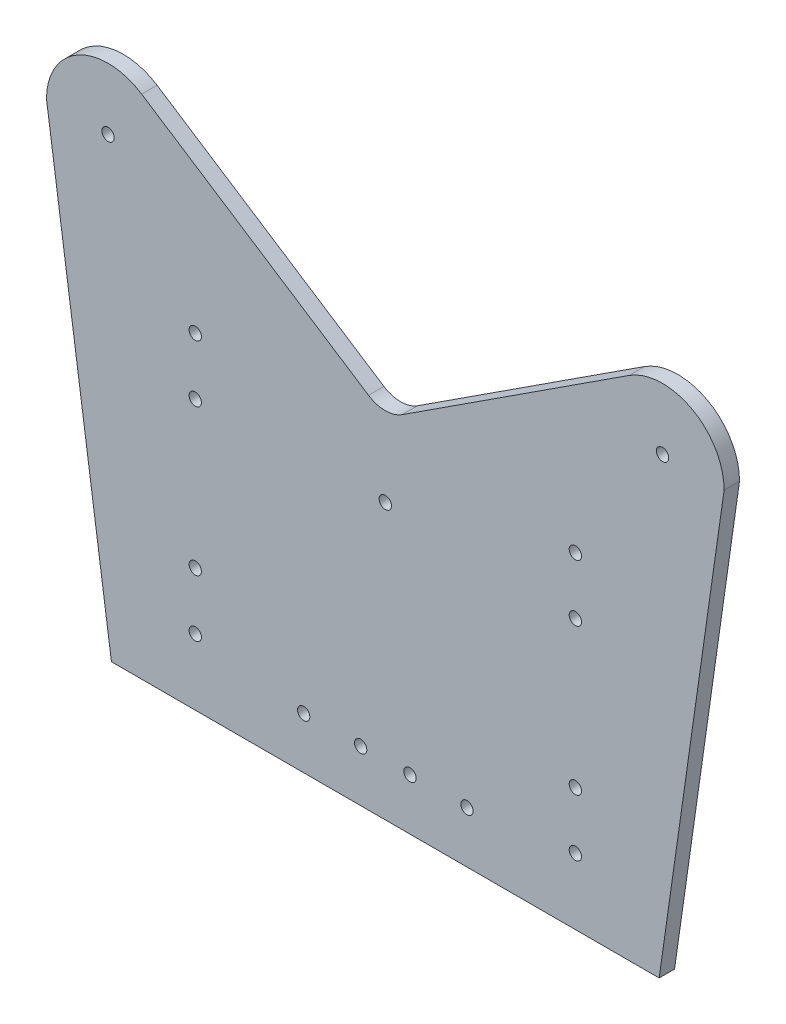
ISO-10303-21;
HEADER;
FILE_DESCRIPTION(('STEP AP214'),'2;1');
FILE_NAME('part.step','',(''),(''),'','','');
FILE_SCHEMA(('AUTOMOTIVE_DESIGN { 1 0 10303 214 1 1 1 1 }'));
ENDSEC;
DATA;
#1=APPLICATION_CONTEXT('core data for automotive mechanical design processes');
#2=APPLICATION_PROTOCOL_DEFINITION('international standard','automotive_design',2000,#1);
#3=PRODUCT_CONTEXT('',#1,'mechanical');
#4=PRODUCT('Part','Part','',(#3));
#5=PRODUCT_RELATED_PRODUCT_CATEGORY('part','',(#4));
#6=PRODUCT_DEFINITION_FORMATION('','',#4);
#7=PRODUCT_DEFINITION_CONTEXT('part definition',#1,'design');
#8=PRODUCT_DEFINITION('design','',#6,#7);
#9=PRODUCT_DEFINITION_SHAPE('','',#8);
#10=(LENGTH_UNIT() NAMED_UNIT(*) SI_UNIT(.MILLI.,.METRE.));
#11=(NAMED_UNIT(*) PLANE_ANGLE_UNIT() SI_UNIT($,.RADIAN.));
#12=(NAMED_UNIT(*) SI_UNIT($,.STERADIAN.) SOLID_ANGLE_UNIT());
#13=UNCERTAINTY_MEASURE_WITH_UNIT(LENGTH_MEASURE(1.E-05),#10,'distance_accuracy_value','');
#14=(GEOMETRIC_REPRESENTATION_CONTEXT(3) GLOBAL_UNCERTAINTY_ASSIGNED_CONTEXT((#13)) GLOBAL_UNIT_ASSIGNED_CONTEXT((#10,
#11,#12)) REPRESENTATION_CONTEXT('',''));
#15=CARTESIAN_POINT('',(0.,0.,0.));
#16=DIRECTION('',(0.,0.,1.));
#17=DIRECTION('',(1.,0.,0.));
#18=AXIS2_PLACEMENT_3D('',#15,#16,#17);
#19=CARTESIAN_POINT('',(-87.1367812034147,-12.437613765437,5.));
#20=DIRECTION('',(0.989966184075695,0.141304474050213,0.));
#21=DIRECTION('',(-0.141304474050213,0.989966184075695,0.));
#22=AXIS2_PLACEMENT_3D('',#19,#20,#21);
#23=PLANE('',#22);
#24=DIRECTION('',(0.141304474050213,-0.989966184075695,0.));
#25=VECTOR('',#24,1.);
#26=CARTESIAN_POINT('',(-87.1367812034147,-12.437613765437,0.));
#27=LINE('',#26,#25);
#28=CARTESIAN_POINT('',(-110.,147.74,0.));
#29=VERTEX_POINT('',#28);
#30=CARTESIAN_POINT('',(-88.9120847439146,0.,0.));
#31=VERTEX_POINT('',#30);
#32=EDGE_CURVE('E203',#29,#31,#27,.T.);
#33=ORIENTED_EDGE('',*,*,#32,.T.);
#34=DIRECTION('',(0.,0.,-1.));
#35=VECTOR('',#34,1.);
#36=CARTESIAN_POINT('',(-88.9120847439146,0.,5.));
#37=LINE('',#36,#35);
#38=CARTESIAN_POINT('',(-88.9120847439146,0.,5.));
#39=VERTEX_POINT('',#38);
#40=EDGE_CURVE('E11',#39,#31,#37,.T.);
#41=ORIENTED_EDGE('',*,*,#40,.F.);
#42=DIRECTION('',(0.141304474050213,-0.989966184075695,0.));
#43=VECTOR('',#42,1.);
#44=CARTESIAN_POINT('',(-87.1367812034147,-12.437613765437,5.));
#45=LINE('',#44,#43);
#46=CARTESIAN_POINT('',(-110.,147.74,5.));
#47=VERTEX_POINT('',#46);
#48=EDGE_CURVE('E322',#47,#39,#45,.T.);
#49=ORIENTED_EDGE('',*,*,#48,.F.);
#50=DIRECTION('',(0.,0.,-1.));
#51=VECTOR('',#50,1.);
#52=CARTESIAN_POINT('',(-110.,147.74,5.));
#53=LINE('',#52,#51);
#54=EDGE_CURVE('E198',#47,#29,#53,.T.);
#55=ORIENTED_EDGE('',*,*,#54,.T.);
#56=EDGE_LOOP('',(#33,#41,#49,#55));
#57=FACE_BOUND('',#56,.T.);
#58=ADVANCED_FACE('F41',(#57),#23,.F.);
#59=CARTESIAN_POINT('',(0.,0.,5.));
#60=DIRECTION('',(0.,1.,0.));
#61=DIRECTION('',(0.,0.,1.));
#62=AXIS2_PLACEMENT_3D('',#59,#60,#61);
#63=PLANE('',#62);
#64=DIRECTION('',(1.,0.,0.));
#65=VECTOR('',#64,1.);
#66=CARTESIAN_POINT('',(0.,0.,0.));
#67=LINE('',#66,#65);
#68=CARTESIAN_POINT('',(88.9120847439146,0.,0.));
#69=VERTEX_POINT('',#68);
#70=EDGE_CURVE('E207',#31,#69,#67,.T.);
#71=ORIENTED_EDGE('',*,*,#70,.T.);
#72=DIRECTION('',(0.,0.,-1.));
#73=VECTOR('',#72,1.);
#74=CARTESIAN_POINT('',(88.9120847439146,0.,5.));
#75=LINE('',#74,#73);
#76=CARTESIAN_POINT('',(88.9120847439146,0.,5.));
#77=VERTEX_POINT('',#76);
#78=EDGE_CURVE('E51',#77,#69,#75,.T.);
#79=ORIENTED_EDGE('',*,*,#78,.F.);
#80=DIRECTION('',(1.,0.,0.));
#81=VECTOR('',#80,1.);
#82=CARTESIAN_POINT('',(0.,0.,5.));
#83=LINE('',#82,#81);
#84=EDGE_CURVE('E98',#39,#77,#83,.T.);
#85=ORIENTED_EDGE('',*,*,#84,.F.);
#86=ORIENTED_EDGE('',*,*,#40,.T.);
#87=EDGE_LOOP('',(#71,#79,#85,#86));
#88=FACE_BOUND('',#87,.T.);
#89=ADVANCED_FACE('F305',(#88),#63,.F.);
#90=CARTESIAN_POINT('',(87.1367812034147,-12.437613765437,5.));
#91=DIRECTION('',(0.989966184075695,-0.141304474050213,0.));
#92=DIRECTION('',(0.141304474050213,0.989966184075695,0.));
#93=AXIS2_PLACEMENT_3D('',#90,#91,#92);
#94=PLANE('',#93);
#95=DIRECTION('',(-0.141304474050213,-0.989966184075695,0.));
#96=VECTOR('',#95,1.);
#97=CARTESIAN_POINT('',(87.1367812034147,-12.437613765437,0.));
#98=LINE('',#97,#96);
#99=CARTESIAN_POINT('',(110.,147.74,0.));
#100=VERTEX_POINT('',#99);
#101=EDGE_CURVE('E211',#100,#69,#98,.T.);
#102=ORIENTED_EDGE('',*,*,#101,.F.);
#103=DIRECTION('',(0.,0.,-1.));
#104=VECTOR('',#103,1.);
#105=CARTESIAN_POINT('',(110.,147.74,5.));
#106=LINE('',#105,#104);
#107=CARTESIAN_POINT('',(110.,147.74,5.));
#108=VERTEX_POINT('',#107);
#109=EDGE_CURVE('E296',#108,#100,#106,.T.);
#110=ORIENTED_EDGE('',*,*,#109,.F.);
#111=DIRECTION('',(-0.141304474050213,-0.989966184075695,0.));
#112=VECTOR('',#111,1.);
#113=CARTESIAN_POINT('',(87.1367812034147,-12.437613765437,5.));
#114=LINE('',#113,#112);
#115=EDGE_CURVE('E304',#108,#77,#114,.T.);
#116=ORIENTED_EDGE('',*,*,#115,.T.);
#117=ORIENTED_EDGE('',*,*,#78,.T.);
#118=EDGE_LOOP('',(#102,#110,#116,#117));
#119=FACE_BOUND('',#118,.T.);
#120=ADVANCED_FACE('F302',(#119),#94,.T.);
#121=CARTESIAN_POINT('',(90.,147.74,5.));
#122=DIRECTION('',(0.,0.,-1.));
#123=DIRECTION('',(-1.,0.,0.));
#124=AXIS2_PLACEMENT_3D('',#121,#122,#123);
#125=CYLINDRICAL_SURFACE('',#124,20.);
#126=CARTESIAN_POINT('',(90.,147.74,0.));
#127=DIRECTION('',(0.,0.,1.));
#128=DIRECTION('',(1.,0.,0.));
#129=AXIS2_PLACEMENT_3D('',#126,#127,#128);
#130=CIRCLE('',#129,20.);
#131=CARTESIAN_POINT('',(79.1041633229118,164.51142638854,0.));
#132=VERTEX_POINT('',#131);
#133=EDGE_CURVE('E215',#132,#100,#130,.F.);
#134=ORIENTED_EDGE('',*,*,#133,.F.);
#135=DIRECTION('',(0.,0.,-1.));
#136=VECTOR('',#135,1.);
#137=CARTESIAN_POINT('',(79.1041633229118,164.51142638854,5.));
#138=LINE('',#137,#136);
#139=CARTESIAN_POINT('',(79.1041633229118,164.51142638854,5.));
#140=VERTEX_POINT('',#139);
#141=EDGE_CURVE('E293',#140,#132,#138,.T.);
#142=ORIENTED_EDGE('',*,*,#141,.F.);
#143=CARTESIAN_POINT('',(90.,147.74,5.));
#144=DIRECTION('',(0.,0.,1.));
#145=DIRECTION('',(1.,0.,0.));
#146=AXIS2_PLACEMENT_3D('',#143,#144,#145);
#147=CIRCLE('',#146,20.);
#148=EDGE_CURVE('E316',#140,#108,#147,.F.);
#149=ORIENTED_EDGE('',*,*,#148,.T.);
#150=ORIENTED_EDGE('',*,*,#109,.T.);
#151=EDGE_LOOP('',(#134,#142,#149,#150));
#152=FACE_BOUND('',#151,.T.);
#153=ADVANCED_FACE('F314',(#152),#125,.T.);
#154=CARTESIAN_POINT('',(-51.6785511315821,79.5462562312706,5.));
#155=DIRECTION('',(0.544791833854411,-0.838571319427005,0.));
#156=DIRECTION('',(0.838571319427005,0.544791833854411,0.));
#157=AXIS2_PLACEMENT_3D('',#154,#155,#156);
#158=PLANE('',#157);
#159=DIRECTION('',(-0.838571319427005,-0.544791833854411,0.));
#160=VECTOR('',#159,1.);
#161=CARTESIAN_POINT('',(-51.6785511315821,79.5462562312706,0.));
#162=LINE('',#161,#160);
#163=CARTESIAN_POINT('',(5.44791833854412,116.659419230363,0.));
#164=VERTEX_POINT('',#163);
#165=EDGE_CURVE('E219',#132,#164,#162,.T.);
#166=ORIENTED_EDGE('',*,*,#165,.T.);
#167=DIRECTION('',(0.,0.,-1.));
#168=VECTOR('',#167,1.);
#169=CARTESIAN_POINT('',(5.44791833854412,116.659419230363,5.));
#170=LINE('',#169,#168);
#171=CARTESIAN_POINT('',(5.44791833854412,116.659419230363,5.));
#172=VERTEX_POINT('',#171);
#173=EDGE_CURVE('E124',#172,#164,#170,.T.);
#174=ORIENTED_EDGE('',*,*,#173,.F.);
#175=DIRECTION('',(-0.838571319427005,-0.544791833854411,0.));
#176=VECTOR('',#175,1.);
#177=CARTESIAN_POINT('',(-51.6785511315821,79.5462562312706,5.));
#178=LINE('',#177,#176);
#179=EDGE_CURVE('E131',#140,#172,#178,.T.);
#180=ORIENTED_EDGE('',*,*,#179,.F.);
#181=ORIENTED_EDGE('',*,*,#141,.T.);
#182=EDGE_LOOP('',(#166,#174,#180,#181));
#183=FACE_BOUND('',#182,.T.);
#184=ADVANCED_FACE('F357',(#183),#158,.F.);
#185=CARTESIAN_POINT('',(0.,125.045132424633,5.));
#186=DIRECTION('',(0.,0.,-1.));
#187=DIRECTION('',(-1.,0.,0.));
#188=AXIS2_PLACEMENT_3D('',#185,#186,#187);
#189=CYLINDRICAL_SURFACE('',#188,10.);
#190=CARTESIAN_POINT('',(0.,125.045132424633,0.));
#191=DIRECTION('',(0.,0.,1.));
#192=DIRECTION('',(1.,0.,0.));
#193=AXIS2_PLACEMENT_3D('',#190,#191,#192);
#194=CIRCLE('',#193,10.);
#195=CARTESIAN_POINT('',(-5.44791833854411,116.659419230363,0.));
#196=VERTEX_POINT('',#195);
#197=EDGE_CURVE('E118',#196,#164,#194,.T.);
#198=ORIENTED_EDGE('',*,*,#197,.F.);
#199=DIRECTION('',(0.,0.,-1.));
#200=VECTOR('',#199,1.);
#201=CARTESIAN_POINT('',(-5.44791833854411,116.659419230363,5.));
#202=LINE('',#201,#200);
#203=CARTESIAN_POINT('',(-5.44791833854411,116.659419230363,5.));
#204=VERTEX_POINT('',#203);
#205=EDGE_CURVE('E113',#204,#196,#202,.T.);
#206=ORIENTED_EDGE('',*,*,#205,.F.);
#207=CARTESIAN_POINT('',(0.,125.045132424633,5.));
#208=DIRECTION('',(0.,0.,1.));
#209=DIRECTION('',(1.,0.,0.));
#210=AXIS2_PLACEMENT_3D('',#207,#208,#209);
#211=CIRCLE('',#210,10.);
#212=EDGE_CURVE('E116',#204,#172,#211,.T.);
#213=ORIENTED_EDGE('',*,*,#212,.T.);
#214=ORIENTED_EDGE('',*,*,#173,.T.);
#215=EDGE_LOOP('',(#198,#206,#213,#214));
#216=FACE_BOUND('',#215,.T.);
#217=ADVANCED_FACE('F115',(#216),#189,.F.);
#218=CARTESIAN_POINT('',(51.6785511315821,79.5462562312705,5.));
#219=DIRECTION('',(0.544791833854411,0.838571319427005,0.));
#220=DIRECTION('',(-0.838571319427005,0.544791833854411,0.));
#221=AXIS2_PLACEMENT_3D('',#218,#219,#220);
#222=PLANE('',#221);
#223=DIRECTION('',(0.838571319427005,-0.544791833854411,0.));
#224=VECTOR('',#223,1.);
#225=CARTESIAN_POINT('',(51.6785511315821,79.5462562312705,0.));
#226=LINE('',#225,#224);
#227=CARTESIAN_POINT('',(-79.1041633229118,164.51142638854,0.));
#228=VERTEX_POINT('',#227);
#229=EDGE_CURVE('E225',#228,#196,#226,.T.);
#230=ORIENTED_EDGE('',*,*,#229,.F.);
#231=DIRECTION('',(0.,0.,-1.));
#232=VECTOR('',#231,1.);
#233=CARTESIAN_POINT('',(-79.1041633229118,164.51142638854,5.));
#234=LINE('',#233,#232);
#235=CARTESIAN_POINT('',(-79.1041633229118,164.51142638854,5.));
#236=VERTEX_POINT('',#235);
#237=EDGE_CURVE('E87',#236,#228,#234,.T.);
#238=ORIENTED_EDGE('',*,*,#237,.F.);
#239=DIRECTION('',(0.838571319427005,-0.544791833854411,0.));
#240=VECTOR('',#239,1.);
#241=CARTESIAN_POINT('',(51.6785511315821,79.5462562312705,5.));
#242=LINE('',#241,#240);
#243=EDGE_CURVE('E128',#236,#204,#242,.T.);
#244=ORIENTED_EDGE('',*,*,#243,.T.);
#245=ORIENTED_EDGE('',*,*,#205,.T.);
#246=EDGE_LOOP('',(#230,#238,#244,#245));
#247=FACE_BOUND('',#246,.T.);
#248=ADVANCED_FACE('F135',(#247),#222,.T.);
#249=CARTESIAN_POINT('',(-61.7,39.973140904193,5.));
#250=DIRECTION('',(0.,0.,-1.));
#251=DIRECTION('',(-1.,0.,0.));
#252=AXIS2_PLACEMENT_3D('',#249,#250,#251);
#253=CYLINDRICAL_SURFACE('',#252,2.);
#254=CARTESIAN_POINT('',(-61.7,39.973140904193,5.));
#255=DIRECTION('',(0.,0.,1.));
#256=DIRECTION('',(1.,0.,0.));
#257=AXIS2_PLACEMENT_3D('',#254,#255,#256);
#258=CIRCLE('',#257,2.);
#259=CARTESIAN_POINT('',(-59.7,39.973140904193,5.));
#260=VERTEX_POINT('',#259);
#261=EDGE_CURVE('E190',#260,#260,#258,.T.);
#262=ORIENTED_EDGE('',*,*,#261,.T.);
#263=EDGE_LOOP('',(#262));
#264=FACE_BOUND('',#263,.T.);
#265=CARTESIAN_POINT('',(-61.7,39.973140904193,0.));
#266=DIRECTION('',(0.,0.,1.));
#267=DIRECTION('',(1.,0.,0.));
#268=AXIS2_PLACEMENT_3D('',#265,#266,#267);
#269=CIRCLE('',#268,2.);
#270=CARTESIAN_POINT('',(-59.7,39.973140904193,0.));
#271=VERTEX_POINT('',#270);
#272=EDGE_CURVE('E278',#271,#271,#269,.T.);
#273=ORIENTED_EDGE('',*,*,#272,.F.);
#274=EDGE_LOOP('',(#273));
#275=FACE_BOUND('',#274,.T.);
#276=ADVANCED_FACE('F365',(#264,#275),#253,.F.);
#277=CARTESIAN_POINT('',(-61.7,21.473140904193,5.));
#278=DIRECTION('',(0.,0.,-1.));
#279=DIRECTION('',(-1.,0.,0.));
#280=AXIS2_PLACEMENT_3D('',#277,#278,#279);
#281=CYLINDRICAL_SURFACE('',#280,2.);
#282=CARTESIAN_POINT('',(-61.7,21.473140904193,5.));
#283=DIRECTION('',(0.,0.,1.));
#284=DIRECTION('',(1.,0.,0.));
#285=AXIS2_PLACEMENT_3D('',#282,#283,#284);
#286=CIRCLE('',#285,2.);
#287=CARTESIAN_POINT('',(-59.7,21.473140904193,5.));
#288=VERTEX_POINT('',#287);
#289=EDGE_CURVE('E186',#288,#288,#286,.T.);
#290=ORIENTED_EDGE('',*,*,#289,.T.);
#291=EDGE_LOOP('',(#290));
#292=FACE_BOUND('',#291,.T.);
#293=CARTESIAN_POINT('',(-61.7,21.473140904193,0.));
#294=DIRECTION('',(0.,0.,1.));
#295=DIRECTION('',(1.,0.,0.));
#296=AXIS2_PLACEMENT_3D('',#293,#294,#295);
#297=CIRCLE('',#296,2.);
#298=CARTESIAN_POINT('',(-59.7,21.473140904193,0.));
#299=VERTEX_POINT('',#298);
#300=EDGE_CURVE('E274',#299,#299,#297,.T.);
#301=ORIENTED_EDGE('',*,*,#300,.F.);
#302=EDGE_LOOP('',(#301));
#303=FACE_BOUND('',#302,.T.);
#304=ADVANCED_FACE('F411',(#292,#303),#281,.F.);
#305=CARTESIAN_POINT('',(61.7,21.473140904193,5.));
#306=DIRECTION('',(0.,0.,-1.));
#307=DIRECTION('',(-1.,0.,0.));
#308=AXIS2_PLACEMENT_3D('',#305,#306,#307);
#309=CYLINDRICAL_SURFACE('',#308,1.99999999999998);
#310=CARTESIAN_POINT('',(61.7,21.473140904193,5.));
#311=DIRECTION('',(0.,0.,1.));
#312=DIRECTION('',(1.,0.,0.));
#313=AXIS2_PLACEMENT_3D('',#310,#311,#312);
#314=CIRCLE('',#313,1.99999999999998);
#315=CARTESIAN_POINT('',(63.7,21.473140904193,5.));
#316=VERTEX_POINT('',#315);
#317=EDGE_CURVE('E182',#316,#316,#314,.F.);
#318=ORIENTED_EDGE('',*,*,#317,.F.);
#319=EDGE_LOOP('',(#318));
#320=FACE_BOUND('',#319,.T.);
#321=CARTESIAN_POINT('',(61.7,21.473140904193,0.));
#322=DIRECTION('',(0.,0.,1.));
#323=DIRECTION('',(1.,0.,0.));
#324=AXIS2_PLACEMENT_3D('',#321,#322,#323);
#325=CIRCLE('',#324,1.99999999999998);
#326=CARTESIAN_POINT('',(63.7,21.473140904193,0.));
#327=VERTEX_POINT('',#326);
#328=EDGE_CURVE('E270',#327,#327,#325,.F.);
#329=ORIENTED_EDGE('',*,*,#328,.T.);
#330=EDGE_LOOP('',(#329));
#331=FACE_BOUND('',#330,.T.);
#332=ADVANCED_FACE('F407',(#320,#331),#309,.F.);
#333=CARTESIAN_POINT('',(61.7,87.473140904193,5.));
#334=DIRECTION('',(0.,0.,-1.));
#335=DIRECTION('',(-1.,0.,0.));
#336=AXIS2_PLACEMENT_3D('',#333,#334,#335);
#337=CYLINDRICAL_SURFACE('',#336,1.99999999999998);
#338=CARTESIAN_POINT('',(61.7,87.473140904193,5.));
#339=DIRECTION('',(0.,0.,1.));
#340=DIRECTION('',(1.,0.,0.));
#341=AXIS2_PLACEMENT_3D('',#338,#339,#340);
#342=CIRCLE('',#341,1.99999999999998);
#343=CARTESIAN_POINT('',(63.7,87.473140904193,5.));
#344=VERTEX_POINT('',#343);
#345=EDGE_CURVE('E178',#344,#344,#342,.F.);
#346=ORIENTED_EDGE('',*,*,#345,.F.);
#347=EDGE_LOOP('',(#346));
#348=FACE_BOUND('',#347,.T.);
#349=CARTESIAN_POINT('',(61.7,87.473140904193,0.));
#350=DIRECTION('',(0.,0.,1.));
#351=DIRECTION('',(1.,0.,0.));
#352=AXIS2_PLACEMENT_3D('',#349,#350,#351);
#353=CIRCLE('',#352,1.99999999999998);
#354=CARTESIAN_POINT('',(63.7,87.473140904193,0.));
#355=VERTEX_POINT('',#354);
#356=EDGE_CURVE('E266',#355,#355,#353,.F.);
#357=ORIENTED_EDGE('',*,*,#356,.T.);
#358=EDGE_LOOP('',(#357));
#359=FACE_BOUND('',#358,.T.);
#360=ADVANCED_FACE('F403',(#348,#359),#337,.F.);
#361=CARTESIAN_POINT('',(61.7,39.973140904193,5.));
#362=DIRECTION('',(0.,0.,-1.));
#363=DIRECTION('',(-1.,0.,0.));
#364=AXIS2_PLACEMENT_3D('',#361,#362,#363);
#365=CYLINDRICAL_SURFACE('',#364,1.99999999999998);
#366=CARTESIAN_POINT('',(61.7,39.973140904193,5.));
#367=DIRECTION('',(0.,0.,1.));
#368=DIRECTION('',(1.,0.,0.));
#369=AXIS2_PLACEMENT_3D('',#366,#367,#368);
#370=CIRCLE('',#369,1.99999999999998);
#371=CARTESIAN_POINT('',(63.7,39.973140904193,5.));
#372=VERTEX_POINT('',#371);
#373=EDGE_CURVE('E174',#372,#372,#370,.F.);
#374=ORIENTED_EDGE('',*,*,#373,.F.);
#375=EDGE_LOOP('',(#374));
#376=FACE_BOUND('',#375,.T.);
#377=CARTESIAN_POINT('',(61.7,39.973140904193,0.));
#378=DIRECTION('',(0.,0.,1.));
#379=DIRECTION('',(1.,0.,0.));
#380=AXIS2_PLACEMENT_3D('',#377,#378,#379);
#381=CIRCLE('',#380,1.99999999999998);
#382=CARTESIAN_POINT('',(63.7,39.973140904193,0.));
#383=VERTEX_POINT('',#382);
#384=EDGE_CURVE('E262',#383,#383,#381,.F.);
#385=ORIENTED_EDGE('',*,*,#384,.T.);
#386=EDGE_LOOP('',(#385));
#387=FACE_BOUND('',#386,.T.);
#388=ADVANCED_FACE('F399',(#376,#387),#365,.F.);
#389=CARTESIAN_POINT('',(-90.,147.74,5.));
#390=DIRECTION('',(0.,0.,-1.));
#391=DIRECTION('',(-1.,0.,0.));
#392=AXIS2_PLACEMENT_3D('',#389,#390,#391);
#393=CYLINDRICAL_SURFACE('',#392,2.);
#394=CARTESIAN_POINT('',(-90.,147.74,5.));
#395=DIRECTION('',(0.,0.,1.));
#396=DIRECTION('',(1.,0.,0.));
#397=AXIS2_PLACEMENT_3D('',#394,#395,#396);
#398=CIRCLE('',#397,2.);
#399=CARTESIAN_POINT('',(-88.,147.74,5.));
#400=VERTEX_POINT('',#399);
#401=EDGE_CURVE('E170',#400,#400,#398,.F.);
#402=ORIENTED_EDGE('',*,*,#401,.F.);
#403=EDGE_LOOP('',(#402));
#404=FACE_BOUND('',#403,.T.);
#405=CARTESIAN_POINT('',(-90.,147.74,0.));
#406=DIRECTION('',(0.,0.,1.));
#407=DIRECTION('',(1.,0.,0.));
#408=AXIS2_PLACEMENT_3D('',#405,#406,#407);
#409=CIRCLE('',#408,2.);
#410=CARTESIAN_POINT('',(-88.,147.74,0.));
#411=VERTEX_POINT('',#410);
#412=EDGE_CURVE('E258',#411,#411,#409,.F.);
#413=ORIENTED_EDGE('',*,*,#412,.T.);
#414=EDGE_LOOP('',(#413));
#415=FACE_BOUND('',#414,.T.);
#416=ADVANCED_FACE('F395',(#404,#415),#393,.F.);
#417=CARTESIAN_POINT('',(8.,16.7,5.));
#418=DIRECTION('',(0.,0.,-1.));
#419=DIRECTION('',(-1.,0.,0.));
#420=AXIS2_PLACEMENT_3D('',#417,#418,#419);
#421=CYLINDRICAL_SURFACE('',#420,2.);
#422=CARTESIAN_POINT('',(8.,16.7,5.));
#423=DIRECTION('',(0.,0.,1.));
#424=DIRECTION('',(1.,0.,0.));
#425=AXIS2_PLACEMENT_3D('',#422,#423,#424);
#426=CIRCLE('',#425,2.);
#427=CARTESIAN_POINT('',(10.,16.7,5.));
#428=VERTEX_POINT('',#427);
#429=EDGE_CURVE('E166',#428,#428,#426,.F.);
#430=ORIENTED_EDGE('',*,*,#429,.F.);
#431=EDGE_LOOP('',(#430));
#432=FACE_BOUND('',#431,.T.);
#433=CARTESIAN_POINT('',(8.,16.7,0.));
#434=DIRECTION('',(0.,0.,1.));
#435=DIRECTION('',(1.,0.,0.));
#436=AXIS2_PLACEMENT_3D('',#433,#434,#435);
#437=CIRCLE('',#436,2.);
#438=CARTESIAN_POINT('',(10.,16.7,0.));
#439=VERTEX_POINT('',#438);
#440=EDGE_CURVE('E254',#439,#439,#437,.F.);
#441=ORIENTED_EDGE('',*,*,#440,.T.);
#442=EDGE_LOOP('',(#441));
#443=FACE_BOUND('',#442,.T.);
#444=ADVANCED_FACE('F391',(#432,#443),#421,.F.);
#445=CARTESIAN_POINT('',(-8.,16.7,5.));
#446=DIRECTION('',(0.,0.,-1.));
#447=DIRECTION('',(-1.,0.,0.));
#448=AXIS2_PLACEMENT_3D('',#445,#446,#447);
#449=CYLINDRICAL_SURFACE('',#448,2.);
#450=CARTESIAN_POINT('',(-8.,16.7,5.));
#451=DIRECTION('',(0.,0.,1.));
#452=DIRECTION('',(1.,0.,0.));
#453=AXIS2_PLACEMENT_3D('',#450,#451,#452);
#454=CIRCLE('',#453,2.);
#455=CARTESIAN_POINT('',(-5.99999999999999,16.7,5.));
#456=VERTEX_POINT('',#455);
#457=EDGE_CURVE('E162',#456,#456,#454,.T.);
#458=ORIENTED_EDGE('',*,*,#457,.T.);
#459=EDGE_LOOP('',(#458));
#460=FACE_BOUND('',#459,.T.);
#461=CARTESIAN_POINT('',(-8.,16.7,0.));
#462=DIRECTION('',(0.,0.,1.));
#463=DIRECTION('',(1.,0.,0.));
#464=AXIS2_PLACEMENT_3D('',#461,#462,#463);
#465=CIRCLE('',#464,2.);
#466=CARTESIAN_POINT('',(-5.99999999999999,16.7,0.));
#467=VERTEX_POINT('',#466);
#468=EDGE_CURVE('E250',#467,#467,#465,.T.);
#469=ORIENTED_EDGE('',*,*,#468,.F.);
#470=EDGE_LOOP('',(#469));
#471=FACE_BOUND('',#470,.T.);
#472=ADVANCED_FACE('F387',(#460,#471),#449,.F.);
#473=CARTESIAN_POINT('',(-26.5,16.7,5.));
#474=DIRECTION('',(0.,0.,-1.));
#475=DIRECTION('',(-1.,0.,0.));
#476=AXIS2_PLACEMENT_3D('',#473,#474,#475);
#477=CYLINDRICAL_SURFACE('',#476,2.);
#478=CARTESIAN_POINT('',(-26.5,16.7,5.));
#479=DIRECTION('',(0.,0.,1.));
#480=DIRECTION('',(1.,0.,0.));
#481=AXIS2_PLACEMENT_3D('',#478,#479,#480);
#482=CIRCLE('',#481,2.);
#483=CARTESIAN_POINT('',(-24.5,16.7,5.));
#484=VERTEX_POINT('',#483);
#485=EDGE_CURVE('E158',#484,#484,#482,.T.);
#486=ORIENTED_EDGE('',*,*,#485,.T.);
#487=EDGE_LOOP('',(#486));
#488=FACE_BOUND('',#487,.T.);
#489=CARTESIAN_POINT('',(-26.5,16.7,0.));
#490=DIRECTION('',(0.,0.,1.));
#491=DIRECTION('',(1.,0.,0.));
#492=AXIS2_PLACEMENT_3D('',#489,#490,#491);
#493=CIRCLE('',#492,2.);
#494=CARTESIAN_POINT('',(-24.5,16.7,0.));
#495=VERTEX_POINT('',#494);
#496=EDGE_CURVE('E246',#495,#495,#493,.T.);
#497=ORIENTED_EDGE('',*,*,#496,.F.);
#498=EDGE_LOOP('',(#497));
#499=FACE_BOUND('',#498,.T.);
#500=ADVANCED_FACE('F383',(#488,#499),#477,.F.);
#501=CARTESIAN_POINT('',(90.,147.74,5.));
#502=DIRECTION('',(0.,0.,-1.));
#503=DIRECTION('',(-1.,0.,0.));
#504=AXIS2_PLACEMENT_3D('',#501,#502,#503);
#505=CYLINDRICAL_SURFACE('',#504,2.);
#506=CARTESIAN_POINT('',(90.,147.74,5.));
#507=DIRECTION('',(0.,0.,1.));
#508=DIRECTION('',(1.,0.,0.));
#509=AXIS2_PLACEMENT_3D('',#506,#507,#508);
#510=CIRCLE('',#509,2.);
#511=CARTESIAN_POINT('',(92.,147.74,5.));
#512=VERTEX_POINT('',#511);
#513=EDGE_CURVE('E154',#512,#512,#510,.T.);
#514=ORIENTED_EDGE('',*,*,#513,.T.);
#515=EDGE_LOOP('',(#514));
#516=FACE_BOUND('',#515,.T.);
#517=CARTESIAN_POINT('',(90.,147.74,0.));
#518=DIRECTION('',(0.,0.,1.));
#519=DIRECTION('',(1.,0.,0.));
#520=AXIS2_PLACEMENT_3D('',#517,#518,#519);
#521=CIRCLE('',#520,2.);
#522=CARTESIAN_POINT('',(92.,147.74,0.));
#523=VERTEX_POINT('',#522);
#524=EDGE_CURVE('E242',#523,#523,#521,.T.);
#525=ORIENTED_EDGE('',*,*,#524,.F.);
#526=EDGE_LOOP('',(#525));
#527=FACE_BOUND('',#526,.T.);
#528=ADVANCED_FACE('F379',(#516,#527),#505,.F.);
#529=CARTESIAN_POINT('',(0.,89.27,5.));
#530=DIRECTION('',(0.,0.,-1.));
#531=DIRECTION('',(-1.,0.,0.));
#532=AXIS2_PLACEMENT_3D('',#529,#530,#531);
#533=CYLINDRICAL_SURFACE('',#532,2.);
#534=CARTESIAN_POINT('',(0.,89.27,5.));
#535=DIRECTION('',(0.,0.,1.));
#536=DIRECTION('',(1.,0.,0.));
#537=AXIS2_PLACEMENT_3D('',#534,#535,#536);
#538=CIRCLE('',#537,2.);
#539=CARTESIAN_POINT('',(2.,89.27,5.));
#540=VERTEX_POINT('',#539);
#541=EDGE_CURVE('E150',#540,#540,#538,.T.);
#542=ORIENTED_EDGE('',*,*,#541,.T.);
#543=EDGE_LOOP('',(#542));
#544=FACE_BOUND('',#543,.T.);
#545=CARTESIAN_POINT('',(0.,89.27,0.));
#546=DIRECTION('',(0.,0.,1.));
#547=DIRECTION('',(1.,0.,0.));
#548=AXIS2_PLACEMENT_3D('',#545,#546,#547);
#549=CIRCLE('',#548,2.);
#550=CARTESIAN_POINT('',(2.,89.27,0.));
#551=VERTEX_POINT('',#550);
#552=EDGE_CURVE('E238',#551,#551,#549,.T.);
#553=ORIENTED_EDGE('',*,*,#552,.F.);
#554=EDGE_LOOP('',(#553));
#555=FACE_BOUND('',#554,.T.);
#556=ADVANCED_FACE('F375',(#544,#555),#533,.F.);
#557=CARTESIAN_POINT('',(26.5,16.7,5.));
#558=DIRECTION('',(0.,0.,-1.));
#559=DIRECTION('',(-1.,0.,0.));
#560=AXIS2_PLACEMENT_3D('',#557,#558,#559);
#561=CYLINDRICAL_SURFACE('',#560,2.00000000000001);
#562=CARTESIAN_POINT('',(26.5,16.7,5.));
#563=DIRECTION('',(0.,0.,1.));
#564=DIRECTION('',(1.,0.,0.));
#565=AXIS2_PLACEMENT_3D('',#562,#563,#564);
#566=CIRCLE('',#565,2.00000000000001);
#567=CARTESIAN_POINT('',(28.5,16.7,5.));
#568=VERTEX_POINT('',#567);
#569=EDGE_CURVE('E146',#568,#568,#566,.F.);
#570=ORIENTED_EDGE('',*,*,#569,.F.);
#571=EDGE_LOOP('',(#570));
#572=FACE_BOUND('',#571,.T.);
#573=CARTESIAN_POINT('',(26.5,16.7,0.));
#574=DIRECTION('',(0.,0.,1.));
#575=DIRECTION('',(1.,0.,0.));
#576=AXIS2_PLACEMENT_3D('',#573,#574,#575);
#577=CIRCLE('',#576,2.00000000000001);
#578=CARTESIAN_POINT('',(28.5,16.7,0.));
#579=VERTEX_POINT('',#578);
#580=EDGE_CURVE('E234',#579,#579,#577,.F.);
#581=ORIENTED_EDGE('',*,*,#580,.T.);
#582=EDGE_LOOP('',(#581));
#583=FACE_BOUND('',#582,.T.);
#584=ADVANCED_FACE('F371',(#572,#583),#561,.F.);
#585=CARTESIAN_POINT('',(-61.7,105.973140904193,5.));
#586=DIRECTION('',(0.,0.,-1.));
#587=DIRECTION('',(-1.,0.,0.));
#588=AXIS2_PLACEMENT_3D('',#585,#586,#587);
#589=CYLINDRICAL_SURFACE('',#588,2.);
#590=CARTESIAN_POINT('',(-61.7,105.973140904193,5.));
#591=DIRECTION('',(0.,0.,1.));
#592=DIRECTION('',(1.,0.,0.));
#593=AXIS2_PLACEMENT_3D('',#590,#591,#592);
#594=CIRCLE('',#593,2.);
#595=CARTESIAN_POINT('',(-59.7,105.973140904193,5.));
#596=VERTEX_POINT('',#595);
#597=EDGE_CURVE('E139',#596,#596,#594,.T.);
#598=ORIENTED_EDGE('',*,*,#597,.T.);
#599=EDGE_LOOP('',(#598));
#600=FACE_BOUND('',#599,.T.);
#601=CARTESIAN_POINT('',(-61.7,105.973140904193,0.));
#602=DIRECTION('',(0.,0.,1.));
#603=DIRECTION('',(1.,0.,0.));
#604=AXIS2_PLACEMENT_3D('',#601,#602,#603);
#605=CIRCLE('',#604,2.);
#606=CARTESIAN_POINT('',(-59.7,105.973140904193,0.));
#607=VERTEX_POINT('',#606);
#608=EDGE_CURVE('E230',#607,#607,#605,.T.);
#609=ORIENTED_EDGE('',*,*,#608,.F.);
#610=EDGE_LOOP('',(#609));
#611=FACE_BOUND('',#610,.T.);
#612=ADVANCED_FACE('F368',(#600,#611),#589,.F.);
#613=CARTESIAN_POINT('',(-90.,147.74,5.));
#614=DIRECTION('',(0.,0.,-1.));
#615=DIRECTION('',(-1.,0.,0.));
#616=AXIS2_PLACEMENT_3D('',#613,#614,#615);
#617=CYLINDRICAL_SURFACE('',#616,20.);
#618=CARTESIAN_POINT('',(-90.,147.74,0.));
#619=DIRECTION('',(0.,0.,1.));
#620=DIRECTION('',(1.,0.,0.));
#621=AXIS2_PLACEMENT_3D('',#618,#619,#620);
#622=CIRCLE('',#621,20.);
#623=EDGE_CURVE('E90',#228,#29,#622,.T.);
#624=ORIENTED_EDGE('',*,*,#623,.T.);
#625=ORIENTED_EDGE('',*,*,#54,.F.);
#626=CARTESIAN_POINT('',(-90.,147.74,5.));
#627=DIRECTION('',(0.,0.,1.));
#628=DIRECTION('',(1.,0.,0.));
#629=AXIS2_PLACEMENT_3D('',#626,#627,#628);
#630=CIRCLE('',#629,20.);
#631=EDGE_CURVE('E59',#236,#47,#630,.T.);
#632=ORIENTED_EDGE('',*,*,#631,.F.);
#633=ORIENTED_EDGE('',*,*,#237,.T.);
#634=EDGE_LOOP('',(#624,#625,#632,#633));
#635=FACE_BOUND('',#634,.T.);
#636=ADVANCED_FACE('F336',(#635),#617,.T.);
#637=CARTESIAN_POINT('',(61.7,105.973140904193,5.));
#638=DIRECTION('',(0.,0.,-1.));
#639=DIRECTION('',(-1.,0.,0.));
#640=AXIS2_PLACEMENT_3D('',#637,#638,#639);
#641=CYLINDRICAL_SURFACE('',#640,1.99999999999998);
#642=CARTESIAN_POINT('',(61.7,105.973140904193,5.));
#643=DIRECTION('',(0.,0.,1.));
#644=DIRECTION('',(1.,0.,0.));
#645=AXIS2_PLACEMENT_3D('',#642,#643,#644);
#646=CIRCLE('',#645,1.99999999999998);
#647=CARTESIAN_POINT('',(63.7,105.973140904193,5.));
#648=VERTEX_POINT('',#647);
#649=EDGE_CURVE('E286',#648,#648,#646,.F.);
#650=ORIENTED_EDGE('',*,*,#649,.F.);
#651=EDGE_LOOP('',(#650));
#652=FACE_BOUND('',#651,.T.);
#653=CARTESIAN_POINT('',(61.7,105.973140904193,0.));
#654=DIRECTION('',(0.,0.,1.));
#655=DIRECTION('',(1.,0.,0.));
#656=AXIS2_PLACEMENT_3D('',#653,#654,#655);
#657=CIRCLE('',#656,1.99999999999998);
#658=CARTESIAN_POINT('',(63.7,105.973140904193,0.));
#659=VERTEX_POINT('',#658);
#660=EDGE_CURVE('E199',#659,#659,#657,.F.);
#661=ORIENTED_EDGE('',*,*,#660,.T.);
#662=EDGE_LOOP('',(#661));
#663=FACE_BOUND('',#662,.T.);
#664=ADVANCED_FACE('F43',(#652,#663),#641,.F.);
#665=CARTESIAN_POINT('',(-61.7,87.473140904193,5.));
#666=DIRECTION('',(0.,0.,-1.));
#667=DIRECTION('',(-1.,0.,0.));
#668=AXIS2_PLACEMENT_3D('',#665,#666,#667);
#669=CYLINDRICAL_SURFACE('',#668,2.);
#670=CARTESIAN_POINT('',(-61.7,87.473140904193,5.));
#671=DIRECTION('',(0.,0.,1.));
#672=DIRECTION('',(1.,0.,0.));
#673=AXIS2_PLACEMENT_3D('',#670,#671,#672);
#674=CIRCLE('',#673,2.);
#675=CARTESIAN_POINT('',(-59.7,87.473140904193,5.));
#676=VERTEX_POINT('',#675);
#677=EDGE_CURVE('E194',#676,#676,#674,.T.);
#678=ORIENTED_EDGE('',*,*,#677,.T.);
#679=EDGE_LOOP('',(#678));
#680=FACE_BOUND('',#679,.T.);
#681=CARTESIAN_POINT('',(-61.7,87.473140904193,0.));
#682=DIRECTION('',(0.,0.,1.));
#683=DIRECTION('',(1.,0.,0.));
#684=AXIS2_PLACEMENT_3D('',#681,#682,#683);
#685=CIRCLE('',#684,2.);
#686=CARTESIAN_POINT('',(-59.7,87.473140904193,0.));
#687=VERTEX_POINT('',#686);
#688=EDGE_CURVE('E282',#687,#687,#685,.T.);
#689=ORIENTED_EDGE('',*,*,#688,.F.);
#690=EDGE_LOOP('',(#689));
#691=FACE_BOUND('',#690,.T.);
#692=ADVANCED_FACE('F335',(#680,#691),#669,.F.);
#693=CARTESIAN_POINT('',(0.,0.,5.));
#694=DIRECTION('',(0.,0.,1.));
#695=DIRECTION('',(1.,0.,0.));
#696=AXIS2_PLACEMENT_3D('',#693,#694,#695);
#697=PLANE('',#696);
#698=ORIENTED_EDGE('',*,*,#649,.T.);
#699=EDGE_LOOP('',(#698));
#700=FACE_BOUND('',#699,.T.);
#701=ORIENTED_EDGE('',*,*,#48,.T.);
#702=ORIENTED_EDGE('',*,*,#84,.T.);
#703=ORIENTED_EDGE('',*,*,#115,.F.);
#704=ORIENTED_EDGE('',*,*,#148,.F.);
#705=ORIENTED_EDGE('',*,*,#179,.T.);
#706=ORIENTED_EDGE('',*,*,#212,.F.);
#707=ORIENTED_EDGE('',*,*,#243,.F.);
#708=ORIENTED_EDGE('',*,*,#631,.T.);
#709=EDGE_LOOP('',(#701,#702,#703,#704,#705,#706,#707,#708));
#710=FACE_BOUND('',#709,.T.);
#711=ORIENTED_EDGE('',*,*,#597,.F.);
#712=EDGE_LOOP('',(#711));
#713=FACE_BOUND('',#712,.T.);
#714=ORIENTED_EDGE('',*,*,#569,.T.);
#715=EDGE_LOOP('',(#714));
#716=FACE_BOUND('',#715,.T.);
#717=ORIENTED_EDGE('',*,*,#541,.F.);
#718=EDGE_LOOP('',(#717));
#719=FACE_BOUND('',#718,.T.);
#720=ORIENTED_EDGE('',*,*,#513,.F.);
#721=EDGE_LOOP('',(#720));
#722=FACE_BOUND('',#721,.T.);
#723=ORIENTED_EDGE('',*,*,#485,.F.);
#724=EDGE_LOOP('',(#723));
#725=FACE_BOUND('',#724,.T.);
#726=ORIENTED_EDGE('',*,*,#457,.F.);
#727=EDGE_LOOP('',(#726));
#728=FACE_BOUND('',#727,.T.);
#729=ORIENTED_EDGE('',*,*,#429,.T.);
#730=EDGE_LOOP('',(#729));
#731=FACE_BOUND('',#730,.T.);
#732=ORIENTED_EDGE('',*,*,#401,.T.);
#733=EDGE_LOOP('',(#732));
#734=FACE_BOUND('',#733,.T.);
#735=ORIENTED_EDGE('',*,*,#373,.T.);
#736=EDGE_LOOP('',(#735));
#737=FACE_BOUND('',#736,.T.);
#738=ORIENTED_EDGE('',*,*,#345,.T.);
#739=EDGE_LOOP('',(#738));
#740=FACE_BOUND('',#739,.T.);
#741=ORIENTED_EDGE('',*,*,#317,.T.);
#742=EDGE_LOOP('',(#741));
#743=FACE_BOUND('',#742,.T.);
#744=ORIENTED_EDGE('',*,*,#289,.F.);
#745=EDGE_LOOP('',(#744));
#746=FACE_BOUND('',#745,.T.);
#747=ORIENTED_EDGE('',*,*,#261,.F.);
#748=EDGE_LOOP('',(#747));
#749=FACE_BOUND('',#748,.T.);
#750=ORIENTED_EDGE('',*,*,#677,.F.);
#751=EDGE_LOOP('',(#750));
#752=FACE_BOUND('',#751,.T.);
#753=ADVANCED_FACE('F126',(#700,#710,#713,#716,#719,#722,#725,#728,#731,#734,#737,#740,#743,
#746,#749,#752),#697,.T.);
#754=CARTESIAN_POINT('',(0.,0.,0.));
#755=DIRECTION('',(0.,0.,1.));
#756=DIRECTION('',(1.,0.,0.));
#757=AXIS2_PLACEMENT_3D('',#754,#755,#756);
#758=PLANE('',#757);
#759=ORIENTED_EDGE('',*,*,#660,.F.);
#760=EDGE_LOOP('',(#759));
#761=FACE_BOUND('',#760,.T.);
#762=ORIENTED_EDGE('',*,*,#32,.F.);
#763=ORIENTED_EDGE('',*,*,#623,.F.);
#764=ORIENTED_EDGE('',*,*,#229,.T.);
#765=ORIENTED_EDGE('',*,*,#197,.T.);
#766=ORIENTED_EDGE('',*,*,#165,.F.);
#767=ORIENTED_EDGE('',*,*,#133,.T.);
#768=ORIENTED_EDGE('',*,*,#101,.T.);
#769=ORIENTED_EDGE('',*,*,#70,.F.);
#770=EDGE_LOOP('',(#762,#763,#764,#765,#766,#767,#768,#769));
#771=FACE_BOUND('',#770,.T.);
#772=ORIENTED_EDGE('',*,*,#608,.T.);
#773=EDGE_LOOP('',(#772));
#774=FACE_BOUND('',#773,.T.);
#775=ORIENTED_EDGE('',*,*,#580,.F.);
#776=EDGE_LOOP('',(#775));
#777=FACE_BOUND('',#776,.T.);
#778=ORIENTED_EDGE('',*,*,#552,.T.);
#779=EDGE_LOOP('',(#778));
#780=FACE_BOUND('',#779,.T.);
#781=ORIENTED_EDGE('',*,*,#524,.T.);
#782=EDGE_LOOP('',(#781));
#783=FACE_BOUND('',#782,.T.);
#784=ORIENTED_EDGE('',*,*,#496,.T.);
#785=EDGE_LOOP('',(#784));
#786=FACE_BOUND('',#785,.T.);
#787=ORIENTED_EDGE('',*,*,#468,.T.);
#788=EDGE_LOOP('',(#787));
#789=FACE_BOUND('',#788,.T.);
#790=ORIENTED_EDGE('',*,*,#440,.F.);
#791=EDGE_LOOP('',(#790));
#792=FACE_BOUND('',#791,.T.);
#793=ORIENTED_EDGE('',*,*,#412,.F.);
#794=EDGE_LOOP('',(#793));
#795=FACE_BOUND('',#794,.T.);
#796=ORIENTED_EDGE('',*,*,#384,.F.);
#797=EDGE_LOOP('',(#796));
#798=FACE_BOUND('',#797,.T.);
#799=ORIENTED_EDGE('',*,*,#356,.F.);
#800=EDGE_LOOP('',(#799));
#801=FACE_BOUND('',#800,.T.);
#802=ORIENTED_EDGE('',*,*,#328,.F.);
#803=EDGE_LOOP('',(#802));
#804=FACE_BOUND('',#803,.T.);
#805=ORIENTED_EDGE('',*,*,#300,.T.);
#806=EDGE_LOOP('',(#805));
#807=FACE_BOUND('',#806,.T.);
#808=ORIENTED_EDGE('',*,*,#272,.T.);
#809=EDGE_LOOP('',(#808));
#810=FACE_BOUND('',#809,.T.);
#811=ORIENTED_EDGE('',*,*,#688,.T.);
#812=EDGE_LOOP('',(#811));
#813=FACE_BOUND('',#812,.T.);
#814=ADVANCED_FACE('F309',(#761,#771,#774,#777,#780,#783,#786,#789,#792,#795,#798,#801,#804,
#807,#810,#813),#758,.F.);
#815=CLOSED_SHELL('',(#58,#89,#120,#153,#184,#217,#248,#276,#304,#332,#360,#388,#416,#444,#472,
#500,#528,#556,#584,#612,#636,#664,#692,#753,#814));
#816=MANIFOLD_SOLID_BREP('B2',#815);
#817=ADVANCED_BREP_SHAPE_REPRESENTATION('',(#18,#816),#14);
#818=SHAPE_DEFINITION_REPRESENTATION(#9,#817);
ENDSEC;
END-ISO-10303-21;
